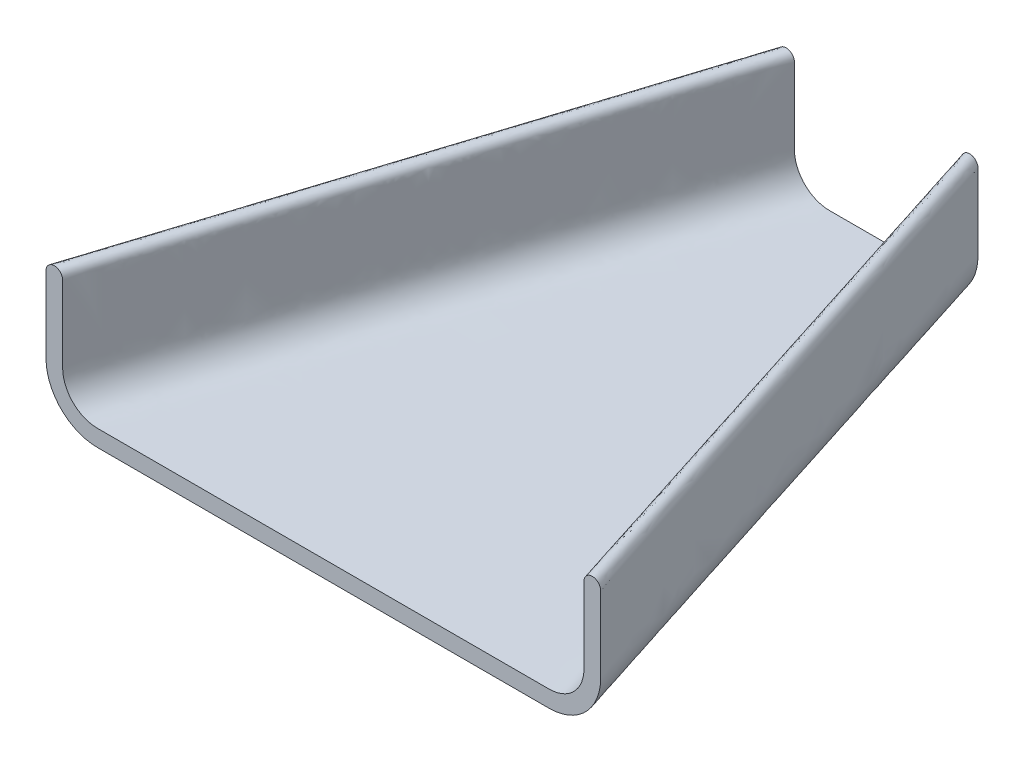
ISO-10303-21;
HEADER;
FILE_DESCRIPTION(('STEP AP214'),'2;1');
FILE_NAME('part.step','',(''),(''),'','','');
FILE_SCHEMA(('AUTOMOTIVE_DESIGN { 1 0 10303 214 1 1 1 1 }'));
ENDSEC;
DATA;
#1=APPLICATION_CONTEXT('core data for automotive mechanical design processes');
#2=APPLICATION_PROTOCOL_DEFINITION('international standard','automotive_design',2000,#1);
#3=PRODUCT_CONTEXT('',#1,'mechanical');
#4=PRODUCT('Part','Part','',(#3));
#5=PRODUCT_RELATED_PRODUCT_CATEGORY('part','',(#4));
#6=PRODUCT_DEFINITION_FORMATION('','',#4);
#7=PRODUCT_DEFINITION_CONTEXT('part definition',#1,'design');
#8=PRODUCT_DEFINITION('design','',#6,#7);
#9=PRODUCT_DEFINITION_SHAPE('','',#8);
#10=(LENGTH_UNIT() NAMED_UNIT(*) SI_UNIT(.MILLI.,.METRE.));
#11=(NAMED_UNIT(*) PLANE_ANGLE_UNIT() SI_UNIT($,.RADIAN.));
#12=(NAMED_UNIT(*) SI_UNIT($,.STERADIAN.) SOLID_ANGLE_UNIT());
#13=UNCERTAINTY_MEASURE_WITH_UNIT(LENGTH_MEASURE(1.E-05),#10,'distance_accuracy_value','');
#14=(GEOMETRIC_REPRESENTATION_CONTEXT(3) GLOBAL_UNCERTAINTY_ASSIGNED_CONTEXT((#13)) GLOBAL_UNIT_ASSIGNED_CONTEXT((#10,
#11,#12)) REPRESENTATION_CONTEXT('',''));
#15=CARTESIAN_POINT('',(0.,0.,0.));
#16=DIRECTION('',(0.,0.,1.));
#17=DIRECTION('',(1.,0.,0.));
#18=AXIS2_PLACEMENT_3D('',#15,#16,#17);
#19=CARTESIAN_POINT('',(16.542930344424,20.,0.));
#20=DIRECTION('',(0.,0.,1.));
#21=DIRECTION('',(1.,0.,0.));
#22=AXIS2_PLACEMENT_3D('',#19,#20,#21);
#23=PLANE('',#22);
#24=CARTESIAN_POINT('',(16.542930344424,20.,0.));
#25=DIRECTION('',(0.,0.,1.));
#26=DIRECTION('',(1.,0.,0.));
#27=AXIS2_PLACEMENT_3D('',#24,#25,#26);
#28=CIRCLE('',#27,1.5);
#29=CARTESIAN_POINT('',(18.042930344424,20.,0.));
#30=VERTEX_POINT('',#29);
#31=CARTESIAN_POINT('',(15.042930344424,20.,0.));
#32=VERTEX_POINT('',#31);
#33=EDGE_CURVE('E571',#30,#32,#28,.T.);
#34=ORIENTED_EDGE('',*,*,#33,.F.);
#35=DIRECTION('',(0.,1.,0.));
#36=VECTOR('',#35,1.);
#37=CARTESIAN_POINT('',(18.042930344424,6.29395077731458,0.));
#38=LINE('',#37,#36);
#39=CARTESIAN_POINT('',(18.0429303444241,6.29395077731458,0.));
#40=VERTEX_POINT('',#39);
#41=EDGE_CURVE('E382',#40,#30,#38,.T.);
#42=ORIENTED_EDGE('',*,*,#41,.F.);
#43=CARTESIAN_POINT('',(8.74897956710952,6.29395077731458,0.));
#44=DIRECTION('',(0.,0.,1.));
#45=DIRECTION('',(-1.,0.,0.));
#46=AXIS2_PLACEMENT_3D('',#43,#44,#45);
#47=CIRCLE('',#46,9.29395077731455);
#48=CARTESIAN_POINT('',(8.74897956710946,-3.,0.));
#49=VERTEX_POINT('',#48);
#50=EDGE_CURVE('E692',#49,#40,#47,.T.);
#51=ORIENTED_EDGE('',*,*,#50,.F.);
#52=DIRECTION('',(1.,0.,0.));
#53=VECTOR('',#52,1.);
#54=CARTESIAN_POINT('',(8.74897956710946,-3.,0.));
#55=LINE('',#54,#53);
#56=CARTESIAN_POINT('',(-8.74897956710943,-2.99999999999993,0.));
#57=VERTEX_POINT('',#56);
#58=EDGE_CURVE('E709',#57,#49,#55,.T.);
#59=ORIENTED_EDGE('',*,*,#58,.F.);
#60=CARTESIAN_POINT('',(-8.74897956710952,6.29395077731458,0.));
#61=DIRECTION('',(0.,0.,1.));
#62=DIRECTION('',(1.,0.,0.));
#63=AXIS2_PLACEMENT_3D('',#60,#61,#62);
#64=CIRCLE('',#63,9.29395077731452);
#65=CARTESIAN_POINT('',(-18.042930344424,6.29395077731458,0.));
#66=VERTEX_POINT('',#65);
#67=EDGE_CURVE('E712',#66,#57,#64,.T.);
#68=ORIENTED_EDGE('',*,*,#67,.F.);
#69=DIRECTION('',(0.,-1.,0.));
#70=VECTOR('',#69,1.);
#71=CARTESIAN_POINT('',(-18.042930344424,6.29395077731458,0.));
#72=LINE('',#71,#70);
#73=CARTESIAN_POINT('',(-18.042930344424,20.,0.));
#74=VERTEX_POINT('',#73);
#75=EDGE_CURVE('E730',#74,#66,#72,.T.);
#76=ORIENTED_EDGE('',*,*,#75,.F.);
#77=CARTESIAN_POINT('',(-16.542930344424,20.,0.));
#78=DIRECTION('',(0.,0.,1.));
#79=DIRECTION('',(-1.,0.,0.));
#80=AXIS2_PLACEMENT_3D('',#77,#78,#79);
#81=CIRCLE('',#80,1.5);
#82=CARTESIAN_POINT('',(-15.042930344424,20.,0.));
#83=VERTEX_POINT('',#82);
#84=EDGE_CURVE('E733',#83,#74,#81,.T.);
#85=ORIENTED_EDGE('',*,*,#84,.F.);
#86=DIRECTION('',(0.,1.,0.));
#87=VECTOR('',#86,1.);
#88=CARTESIAN_POINT('',(-15.042930344424,6.29395077731458,0.));
#89=LINE('',#88,#87);
#90=CARTESIAN_POINT('',(-15.0429303444241,6.29395077731458,0.));
#91=VERTEX_POINT('',#90);
#92=EDGE_CURVE('E751',#91,#83,#89,.T.);
#93=ORIENTED_EDGE('',*,*,#92,.F.);
#94=CARTESIAN_POINT('',(-8.74897956710952,6.29395077731458,0.));
#95=DIRECTION('',(0.,0.,-1.));
#96=DIRECTION('',(1.,0.,0.));
#97=AXIS2_PLACEMENT_3D('',#94,#95,#96);
#98=CIRCLE('',#97,6.29395077731455);
#99=CARTESIAN_POINT('',(-8.74897956710946,0.,0.));
#100=VERTEX_POINT('',#99);
#101=EDGE_CURVE('E754',#100,#91,#98,.T.);
#102=ORIENTED_EDGE('',*,*,#101,.F.);
#103=DIRECTION('',(-1.,0.,0.));
#104=VECTOR('',#103,1.);
#105=CARTESIAN_POINT('',(8.74897956710946,0.,0.));
#106=LINE('',#105,#104);
#107=CARTESIAN_POINT('',(8.74897956710946,0.,0.));
#108=VERTEX_POINT('',#107);
#109=EDGE_CURVE('E772',#108,#100,#106,.T.);
#110=ORIENTED_EDGE('',*,*,#109,.F.);
#111=CARTESIAN_POINT('',(8.74897956710952,6.29395077731458,0.));
#112=DIRECTION('',(0.,0.,-1.));
#113=DIRECTION('',(-1.,0.,0.));
#114=AXIS2_PLACEMENT_3D('',#111,#112,#113);
#115=CIRCLE('',#114,6.29395077731455);
#116=CARTESIAN_POINT('',(15.042930344424,6.29395077731458,0.));
#117=VERTEX_POINT('',#116);
#118=EDGE_CURVE('E775',#117,#108,#115,.T.);
#119=ORIENTED_EDGE('',*,*,#118,.F.);
#120=DIRECTION('',(0.,-1.,0.));
#121=VECTOR('',#120,1.);
#122=CARTESIAN_POINT('',(15.042930344424,6.29395077731458,0.));
#123=LINE('',#122,#121);
#124=EDGE_CURVE('E792',#32,#117,#123,.T.);
#125=ORIENTED_EDGE('',*,*,#124,.F.);
#126=EDGE_LOOP('',(#34,#42,#51,#59,#68,#76,#85,#93,#102,#110,#119,#125));
#127=FACE_BOUND('',#126,.T.);
#128=ADVANCED_FACE('F323',(#127),#23,.F.);
#129=CARTESIAN_POINT('',(48.5,20.,100.));
#130=DIRECTION('',(0.,0.,-1.));
#131=DIRECTION('',(-1.,0.,0.));
#132=AXIS2_PLACEMENT_3D('',#129,#130,#131);
#133=PLANE('',#132);
#134=CARTESIAN_POINT('',(48.5,20.,100.));
#135=DIRECTION('',(0.,0.,1.));
#136=DIRECTION('',(-1.,0.,0.));
#137=AXIS2_PLACEMENT_3D('',#134,#135,#136);
#138=CIRCLE('',#137,1.5);
#139=CARTESIAN_POINT('',(50.,20.,100.));
#140=VERTEX_POINT('',#139);
#141=CARTESIAN_POINT('',(47.,20.,100.));
#142=VERTEX_POINT('',#141);
#143=EDGE_CURVE('E582',#140,#142,#138,.T.);
#144=ORIENTED_EDGE('',*,*,#143,.T.);
#145=DIRECTION('',(0.,-1.,0.));
#146=VECTOR('',#145,1.);
#147=CARTESIAN_POINT('',(47.,6.29395077731458,100.));
#148=LINE('',#147,#146);
#149=CARTESIAN_POINT('',(47.,6.29395077731459,100.));
#150=VERTEX_POINT('',#149);
#151=EDGE_CURVE('E12',#142,#150,#148,.T.);
#152=ORIENTED_EDGE('',*,*,#151,.T.);
#153=CARTESIAN_POINT('',(40.7060492226855,6.29395077731458,100.));
#154=DIRECTION('',(0.,0.,-1.));
#155=DIRECTION('',(-1.,0.,0.));
#156=AXIS2_PLACEMENT_3D('',#153,#154,#155);
#157=CIRCLE('',#156,6.29395077731452);
#158=CARTESIAN_POINT('',(40.7060492226855,0.,100.));
#159=VERTEX_POINT('',#158);
#160=EDGE_CURVE('E334',#150,#159,#157,.T.);
#161=ORIENTED_EDGE('',*,*,#160,.T.);
#162=DIRECTION('',(-1.,0.,0.));
#163=VECTOR('',#162,1.);
#164=CARTESIAN_POINT('',(40.7060492226855,0.,100.));
#165=LINE('',#164,#163);
#166=CARTESIAN_POINT('',(-40.7060492226855,0.,100.));
#167=VERTEX_POINT('',#166);
#168=EDGE_CURVE('E424',#159,#167,#165,.T.);
#169=ORIENTED_EDGE('',*,*,#168,.T.);
#170=CARTESIAN_POINT('',(-40.7060492226855,6.29395077731458,100.));
#171=DIRECTION('',(0.,0.,-1.));
#172=DIRECTION('',(1.,0.,0.));
#173=AXIS2_PLACEMENT_3D('',#170,#171,#172);
#174=CIRCLE('',#173,6.29395077731452);
#175=CARTESIAN_POINT('',(-47.,6.29395077731458,100.));
#176=VERTEX_POINT('',#175);
#177=EDGE_CURVE('E434',#167,#176,#174,.T.);
#178=ORIENTED_EDGE('',*,*,#177,.T.);
#179=DIRECTION('',(0.,1.,0.));
#180=VECTOR('',#179,1.);
#181=CARTESIAN_POINT('',(-47.,6.29395077731458,100.));
#182=LINE('',#181,#180);
#183=CARTESIAN_POINT('',(-47.,20.,100.));
#184=VERTEX_POINT('',#183);
#185=EDGE_CURVE('E605',#176,#184,#182,.T.);
#186=ORIENTED_EDGE('',*,*,#185,.T.);
#187=CARTESIAN_POINT('',(-48.5,20.,100.));
#188=DIRECTION('',(0.,0.,1.));
#189=DIRECTION('',(-1.,0.,0.));
#190=AXIS2_PLACEMENT_3D('',#187,#188,#189);
#191=CIRCLE('',#190,1.5);
#192=CARTESIAN_POINT('',(-50.,20.,100.));
#193=VERTEX_POINT('',#192);
#194=EDGE_CURVE('E622',#184,#193,#191,.T.);
#195=ORIENTED_EDGE('',*,*,#194,.T.);
#196=DIRECTION('',(0.,-1.,0.));
#197=VECTOR('',#196,1.);
#198=CARTESIAN_POINT('',(-50.,6.29395077731458,100.));
#199=LINE('',#198,#197);
#200=CARTESIAN_POINT('',(-50.,6.29395077731459,100.));
#201=VERTEX_POINT('',#200);
#202=EDGE_CURVE('E625',#193,#201,#199,.T.);
#203=ORIENTED_EDGE('',*,*,#202,.T.);
#204=CARTESIAN_POINT('',(-40.7060492226855,6.29395077731458,100.));
#205=DIRECTION('',(0.,0.,1.));
#206=DIRECTION('',(1.,0.,0.));
#207=AXIS2_PLACEMENT_3D('',#204,#205,#206);
#208=CIRCLE('',#207,9.29395077731452);
#209=CARTESIAN_POINT('',(-40.7060492226855,-2.99999999999993,100.));
#210=VERTEX_POINT('',#209);
#211=EDGE_CURVE('E643',#201,#210,#208,.T.);
#212=ORIENTED_EDGE('',*,*,#211,.T.);
#213=DIRECTION('',(1.,0.,0.));
#214=VECTOR('',#213,1.);
#215=CARTESIAN_POINT('',(40.7060492226855,-2.99999999999993,100.));
#216=LINE('',#215,#214);
#217=CARTESIAN_POINT('',(40.7060492226855,-2.99999999999994,100.));
#218=VERTEX_POINT('',#217);
#219=EDGE_CURVE('E646',#210,#218,#216,.T.);
#220=ORIENTED_EDGE('',*,*,#219,.T.);
#221=CARTESIAN_POINT('',(40.7060492226855,6.29395077731458,100.));
#222=DIRECTION('',(0.,0.,1.));
#223=DIRECTION('',(-1.,0.,0.));
#224=AXIS2_PLACEMENT_3D('',#221,#222,#223);
#225=CIRCLE('',#224,9.29395077731452);
#226=CARTESIAN_POINT('',(50.,6.29395077731458,100.));
#227=VERTEX_POINT('',#226);
#228=EDGE_CURVE('E396',#218,#227,#225,.T.);
#229=ORIENTED_EDGE('',*,*,#228,.T.);
#230=DIRECTION('',(0.,1.,0.));
#231=VECTOR('',#230,1.);
#232=CARTESIAN_POINT('',(50.,6.29395077731458,100.));
#233=LINE('',#232,#231);
#234=EDGE_CURVE('E664',#227,#140,#233,.T.);
#235=ORIENTED_EDGE('',*,*,#234,.T.);
#236=EDGE_LOOP('',(#144,#152,#161,#169,#178,#186,#195,#203,#212,#220,#229,#235));
#237=FACE_BOUND('',#236,.T.);
#238=ADVANCED_FACE('F423',(#237),#133,.F.);
#239=CARTESIAN_POINT('',(50.,19.999999998663,100.));
#240=CARTESIAN_POINT('',(18.042930344424,19.999999998663,0.));
#241=CARTESIAN_POINT('',(50.,18.8578292314429,100.));
#242=CARTESIAN_POINT('',(18.042930344424,18.8578292314429,0.));
#243=CARTESIAN_POINT('',(50.,16.5734876943287,100.));
#244=CARTESIAN_POINT('',(18.042930344424,16.5734876943286,0.));
#245=CARTESIAN_POINT('',(50.,13.1469753886573,99.9999999999998));
#246=CARTESIAN_POINT('',(18.0429303444241,13.1469753886573,0.));
#247=CARTESIAN_POINT('',(50.,9.72046308298594,100.));
#248=CARTESIAN_POINT('',(18.042930344424,9.72046308298595,0.));
#249=CARTESIAN_POINT('',(50.,7.4361215458717,100.));
#250=CARTESIAN_POINT('',(18.042930344424,7.4361215458717,0.));
#251=CARTESIAN_POINT('',(50.,5.68566312533838,100.));
#252=CARTESIAN_POINT('',(18.0429303444241,5.68566312533838,0.));
#253=CARTESIAN_POINT('',(49.8825699201602,4.53366509057306,100.));
#254=CARTESIAN_POINT('',(17.9253386328897,4.36002704274886,0.));
#255=CARTESIAN_POINT('',(49.4301439600059,2.95732924128206,100.));
#256=CARTESIAN_POINT('',(17.1854262661475,2.14629958613332,0.));
#257=CARTESIAN_POINT('',(48.7321299519958,1.51884081533093,100.));
#258=CARTESIAN_POINT('',(15.8325540593502,0.12704362948251,0.));
#259=CARTESIAN_POINT('',(47.9546812795262,0.433445241536176,100.));
#260=CARTESIAN_POINT('',(14.4747003469939,-1.07731235442002,0.));
#261=CARTESIAN_POINT('',(47.2102428896823,-0.36188075218266,100.));
#262=CARTESIAN_POINT('',(13.4063591227669,-1.7663939407779,0.));
#263=CARTESIAN_POINT('',(46.5870871794764,-0.919311576530071,100.));
#264=CARTESIAN_POINT('',(12.6273560435513,-2.16560625194271,0.));
#265=CARTESIAN_POINT('',(45.8936023635969,-1.43412976027311,100.));
#266=CARTESIAN_POINT('',(11.8838877694159,-2.46682240628237,0.));
#267=CARTESIAN_POINT('',(45.1220447071405,-1.90150554463326,100.));
#268=CARTESIAN_POINT('',(11.1784290264897,-2.68597390112525,0.));
#269=CARTESIAN_POINT('',(44.2577333597661,-2.31315591659491,99.9999999999999));
#270=CARTESIAN_POINT('',(10.5134545409021,-2.83899223379972,0.));
#271=CARTESIAN_POINT('',(43.2820445231359,-2.65852919991347,100.));
#272=CARTESIAN_POINT('',(9.88721581152224,-2.93665405023179,0.));
#273=CARTESIAN_POINT('',(42.1493071113567,-2.91388784260737,99.9999999999999));
#274=CARTESIAN_POINT('',(9.29796433721957,-2.98973599634747,0.));
#275=CARTESIAN_POINT('',(41.2425850487104,-2.99999999999994,100.));
#276=CARTESIAN_POINT('',(8.9283456443705,-2.99999999999997,0.));
#277=CARTESIAN_POINT('',(34.8512756917669,-2.99999999999993,100.));
#278=CARTESIAN_POINT('',(6.79170530776879,-2.99999999999999,0.));
#279=CARTESIAN_POINT('',(22.0772925383462,-2.99999999999993,99.9999999999999));
#280=CARTESIAN_POINT('',(3.9054651450008,-2.99999999999998,0.));
#281=CARTESIAN_POINT('',(0.,-2.99999999999993,100.));
#282=CARTESIAN_POINT('',(0.,-2.99999999999997,0.));
#283=CARTESIAN_POINT('',(-22.0772925383462,-2.99999999999993,99.9999999999999));
#284=CARTESIAN_POINT('',(-3.90546514500079,-2.99999999999995,0.));
#285=CARTESIAN_POINT('',(-34.8512756917669,-2.99999999999993,100.));
#286=CARTESIAN_POINT('',(-6.79170530776876,-2.99999999999994,0.));
#287=CARTESIAN_POINT('',(-41.2425850487104,-2.99999999999994,100.));
#288=CARTESIAN_POINT('',(-8.92834564437047,-2.99999999999994,0.));
#289=CARTESIAN_POINT('',(-42.1493071113567,-2.91388784260737,100.));
#290=CARTESIAN_POINT('',(-9.29796433721954,-2.98973599634744,0.));
#291=CARTESIAN_POINT('',(-43.282044523136,-2.65852919991347,100.));
#292=CARTESIAN_POINT('',(-9.8872158115222,-2.93665405023176,0.));
#293=CARTESIAN_POINT('',(-44.2577333597661,-2.31315591659491,99.9999999999998));
#294=CARTESIAN_POINT('',(-10.513454540902,-2.83899223379969,0.));
#295=CARTESIAN_POINT('',(-45.1220447071406,-1.90150554463327,100.));
#296=CARTESIAN_POINT('',(-11.1784290264897,-2.68597390112522,0.));
#297=CARTESIAN_POINT('',(-45.8936023635967,-1.43412976027311,99.9999999999997));
#298=CARTESIAN_POINT('',(-11.8838877694158,-2.46682240628235,0.));
#299=CARTESIAN_POINT('',(-46.5870871794766,-0.919311576530093,100.));
#300=CARTESIAN_POINT('',(-12.6273560435513,-2.16560625194269,0.));
#301=CARTESIAN_POINT('',(-47.2102428896822,-0.361880752182655,99.9999999999998));
#302=CARTESIAN_POINT('',(-13.4063591227669,-1.76639394077788,0.));
#303=CARTESIAN_POINT('',(-47.9546812795263,0.433445241536191,100.));
#304=CARTESIAN_POINT('',(-14.4747003469939,-1.07731235442,0.));
#305=CARTESIAN_POINT('',(-48.7321299519958,1.51884081533094,100.));
#306=CARTESIAN_POINT('',(-15.8325540593501,0.127043629482522,0.));
#307=CARTESIAN_POINT('',(-49.4301439600059,2.95732924128206,100.));
#308=CARTESIAN_POINT('',(-17.1854262661476,2.14629958613334,0.));
#309=CARTESIAN_POINT('',(-49.8825699201602,4.53366509057307,100.));
#310=CARTESIAN_POINT('',(-17.9253386328896,4.36002704274886,0.));
#311=CARTESIAN_POINT('',(-50.,5.68566312533838,100.));
#312=CARTESIAN_POINT('',(-18.042930344424,5.68566312533838,0.));
#313=CARTESIAN_POINT('',(-50.,7.4361215458717,100.));
#314=CARTESIAN_POINT('',(-18.042930344424,7.43612154587171,0.));
#315=CARTESIAN_POINT('',(-50.,9.72046308298593,100.));
#316=CARTESIAN_POINT('',(-18.042930344424,9.72046308298596,0.));
#317=CARTESIAN_POINT('',(-50.,13.1469753886573,100.));
#318=CARTESIAN_POINT('',(-18.042930344424,13.1469753886573,0.));
#319=CARTESIAN_POINT('',(-50.,16.5734876943286,100.));
#320=CARTESIAN_POINT('',(-18.042930344424,16.5734876943287,0.));
#321=CARTESIAN_POINT('',(-50.,18.8578292314429,100.));
#322=CARTESIAN_POINT('',(-18.042930344424,18.8578292314429,0.));
#323=CARTESIAN_POINT('',(-50.,20.1963495392825,100.));
#324=CARTESIAN_POINT('',(-18.042930344424,20.1963495392825,0.));
#325=CARTESIAN_POINT('',(-49.922003383986,20.588925468703,100.));
#326=CARTESIAN_POINT('',(-17.9649337284101,20.588925468703,0.));
#327=CARTESIAN_POINT('',(-49.5883206779812,21.088294672356,100.));
#328=CARTESIAN_POINT('',(-17.6312510224051,21.088294672356,0.));
#329=CARTESIAN_POINT('',(-49.0890286629882,21.4219276690566,100.));
#330=CARTESIAN_POINT('',(-17.1319590074122,21.4219276690567,0.));
#331=CARTESIAN_POINT('',(-48.5,21.5391167795175,99.9999999999999));
#332=CARTESIAN_POINT('',(-16.542930344424,21.5391167795174,0.));
#333=CARTESIAN_POINT('',(-47.9109713370118,21.4219276690567,100.));
#334=CARTESIAN_POINT('',(-15.9539016814359,21.4219276690567,0.));
#335=CARTESIAN_POINT('',(-47.4116793220188,21.088294672356,99.9999999999997));
#336=CARTESIAN_POINT('',(-15.4546096664429,21.088294672356,0.));
#337=CARTESIAN_POINT('',(-47.0779966160141,20.588925468703,100.));
#338=CARTESIAN_POINT('',(-15.120926960438,20.588925468703,0.));
#339=CARTESIAN_POINT('',(-47.,20.1963495392825,100.));
#340=CARTESIAN_POINT('',(-15.042930344424,20.1963495392825,0.));
#341=CARTESIAN_POINT('',(-47.,18.8578292314429,100.));
#342=CARTESIAN_POINT('',(-15.042930344424,18.8578292314429,0.));
#343=CARTESIAN_POINT('',(-47.,16.5734876943286,100.));
#344=CARTESIAN_POINT('',(-15.042930344424,16.5734876943286,0.));
#345=CARTESIAN_POINT('',(-47.,13.1469753886573,99.9999999999999));
#346=CARTESIAN_POINT('',(-15.042930344424,13.1469753886573,0.));
#347=CARTESIAN_POINT('',(-47.,9.72046308298592,100.));
#348=CARTESIAN_POINT('',(-15.042930344424,9.72046308298595,0.));
#349=CARTESIAN_POINT('',(-47.,7.4361215458717,100.));
#350=CARTESIAN_POINT('',(-15.042930344424,7.4361215458717,0.));
#351=CARTESIAN_POINT('',(-47.,5.88201266491017,100.));
#352=CARTESIAN_POINT('',(-15.0429303444241,5.88201266491017,0.));
#353=CARTESIAN_POINT('',(-46.9205775648785,5.10404675924423,100.));
#354=CARTESIAN_POINT('',(-14.9651704546356,4.97244858121912,0.));
#355=CARTESIAN_POINT('',(-46.616569705205,4.04186129316876,100.));
#356=CARTESIAN_POINT('',(-14.426942350523,3.39356601317859,0.));
#357=CARTESIAN_POINT('',(-46.1485603140774,3.07314053381272,99.9999999999999));
#358=CARTESIAN_POINT('',(-13.4229507976012,1.97310345912587,0.));
#359=CARTESIAN_POINT('',(-45.627746407008,2.34145875803284,100.));
#360=CARTESIAN_POINT('',(-12.4710214411584,1.18707185197433,0.));
#361=CARTESIAN_POINT('',(-45.1287191672775,1.80436012658664,100.));
#362=CARTESIAN_POINT('',(-11.7501916074446,0.750661439859971,0.));
#363=CARTESIAN_POINT('',(-44.7107846879087,1.42720314169401,100.));
#364=CARTESIAN_POINT('',(-11.2349029266896,0.503244697811797,0.));
#365=CARTESIAN_POINT('',(-44.2449743100732,1.07804811210398,100.));
#366=CARTESIAN_POINT('',(-10.7499248092749,0.31940265303537,0.));
#367=CARTESIAN_POINT('',(-43.7261098905729,0.759851856499558,99.9999999999998));
#368=CARTESIAN_POINT('',(-10.2947782740661,0.187451080616624,0.));
#369=CARTESIAN_POINT('',(-43.1428103353389,0.478388956702905,100.));
#370=CARTESIAN_POINT('',(-9.86898433992828,0.0957057556414825,0.));
#371=CARTESIAN_POINT('',(-42.4824864852802,0.240216961644608,99.9999999999999));
#372=CARTESIAN_POINT('',(-9.47027667991423,0.0374621882537071,0.));
#373=CARTESIAN_POINT('',(-41.7093318638814,0.0622614786867903,100.));
#374=CARTESIAN_POINT('',(-9.09638896707652,0.00601588859705895,0.));
#375=CARTESIAN_POINT('',(-41.0843144958792,0.,100.));
#376=CARTESIAN_POINT('',(-8.86243797721806,0.,0.));
#377=CARTESIAN_POINT('',(-34.6108925580216,0.,100.));
#378=CARTESIAN_POINT('',(-6.92077371914241,0.,0.));
#379=CARTESIAN_POINT('',(-21.5606299436071,0.,100.));
#380=CARTESIAN_POINT('',(-3.98434471637314,0.,0.));
#381=CARTESIAN_POINT('',(0.,0.,99.9999999999999));
#382=CARTESIAN_POINT('',(0.,0.,0.));
#383=CARTESIAN_POINT('',(21.5606299436071,0.,100.));
#384=CARTESIAN_POINT('',(3.98434471637314,0.,0.));
#385=CARTESIAN_POINT('',(34.6108925580216,0.,100.));
#386=CARTESIAN_POINT('',(6.92077371914241,0.,0.));
#387=CARTESIAN_POINT('',(41.0843144958792,0.,100.));
#388=CARTESIAN_POINT('',(8.86243797721806,0.,0.));
#389=CARTESIAN_POINT('',(41.7093318638814,0.06226147868679,100.));
#390=CARTESIAN_POINT('',(9.09638896707652,0.00601588859705939,0.));
#391=CARTESIAN_POINT('',(42.4824864852802,0.240216961644613,100.));
#392=CARTESIAN_POINT('',(9.47027667991423,0.0374621882537079,0.));
#393=CARTESIAN_POINT('',(43.1428103353389,0.478388956702892,100.));
#394=CARTESIAN_POINT('',(9.86898433992827,0.0957057556414819,0.));
#395=CARTESIAN_POINT('',(43.7261098905729,0.759851856499542,99.9999999999999));
#396=CARTESIAN_POINT('',(10.294778274066,0.18745108061662,0.));
#397=CARTESIAN_POINT('',(44.2449743100731,1.07804811210397,100.));
#398=CARTESIAN_POINT('',(10.7499248092749,0.319402653035363,0.));
#399=CARTESIAN_POINT('',(44.7107846879086,1.42720314169398,99.9999999999999));
#400=CARTESIAN_POINT('',(11.2349029266895,0.503244697811781,0.));
#401=CARTESIAN_POINT('',(45.1287191672775,1.80436012658662,100.));
#402=CARTESIAN_POINT('',(11.7501916074446,0.750661439859957,0.));
#403=CARTESIAN_POINT('',(45.6277464070079,2.34145875803283,99.9999999999999));
#404=CARTESIAN_POINT('',(12.4710214411583,1.18707185197432,0.));
#405=CARTESIAN_POINT('',(46.1485603140774,3.07314053381273,100.));
#406=CARTESIAN_POINT('',(13.4229507976012,1.97310345912587,0.));
#407=CARTESIAN_POINT('',(46.616569705205,4.04186129316877,100.));
#408=CARTESIAN_POINT('',(14.426942350523,3.39356601317858,0.));
#409=CARTESIAN_POINT('',(46.9205775648785,5.10404675924426,100.));
#410=CARTESIAN_POINT('',(14.9651704546357,4.97244858121912,0.));
#411=CARTESIAN_POINT('',(47.,5.88201266491018,100.));
#412=CARTESIAN_POINT('',(15.0429303444241,5.88201266491017,0.));
#413=CARTESIAN_POINT('',(47.,7.4361215458717,100.));
#414=CARTESIAN_POINT('',(15.042930344424,7.4361215458717,0.));
#415=CARTESIAN_POINT('',(47.0000000000001,9.72046308298595,100.));
#416=CARTESIAN_POINT('',(15.0429303444241,9.72046308298594,0.));
#417=CARTESIAN_POINT('',(46.9999999999999,13.1469753886573,100.));
#418=CARTESIAN_POINT('',(15.042930344424,13.1469753886573,0.));
#419=CARTESIAN_POINT('',(47.,16.5734876943287,100.));
#420=CARTESIAN_POINT('',(15.042930344424,16.5734876943286,0.));
#421=CARTESIAN_POINT('',(47.,18.8578292314429,100.));
#422=CARTESIAN_POINT('',(15.042930344424,18.8578292314429,0.));
#423=CARTESIAN_POINT('',(47.,20.1963495392825,100.));
#424=CARTESIAN_POINT('',(15.042930344424,20.1963495392825,0.));
#425=CARTESIAN_POINT('',(47.0779966160139,20.588925468703,100.));
#426=CARTESIAN_POINT('',(15.120926960438,20.588925468703,0.));
#427=CARTESIAN_POINT('',(47.4116793220189,21.088294672356,100.));
#428=CARTESIAN_POINT('',(15.4546096664429,21.0882946723559,0.));
#429=CARTESIAN_POINT('',(47.9109713370117,21.4219276690567,99.9999999999999));
#430=CARTESIAN_POINT('',(15.9539016814358,21.4219276690567,0.));
#431=CARTESIAN_POINT('',(48.5000000000001,21.5391167795175,100.));
#432=CARTESIAN_POINT('',(16.5429303444241,21.5391167795175,0.));
#433=CARTESIAN_POINT('',(49.0890286629881,21.4219276690567,99.9999999999997));
#434=CARTESIAN_POINT('',(17.1319590074122,21.4219276690567,0.));
#435=CARTESIAN_POINT('',(49.5883206779813,21.088294672356,100.));
#436=CARTESIAN_POINT('',(17.6312510224052,21.088294672356,0.));
#437=CARTESIAN_POINT('',(49.9220033839859,20.588925468703,99.9999999999998));
#438=CARTESIAN_POINT('',(17.96493372841,20.588925468703,0.));
#439=CARTESIAN_POINT('',(50.,20.1963495392825,100.));
#440=CARTESIAN_POINT('',(18.042930344424,20.1963495392825,0.));
#441=CARTESIAN_POINT('',(50.,19.999999998663,100.));
#442=CARTESIAN_POINT('',(18.042930344424,19.999999998663,0.));
#443=B_SPLINE_SURFACE_WITH_KNOTS('',3,1,((#239,#240),(#241,#242),(#243,#244),(#245,#246),(#247,
#248),(#249,#250),(#251,#252),(#253,#254),(#255,#256),(#257,#258),(#259,#260),(#261,#262),(#263,
#264),(#265,#266),(#267,#268),(#269,#270),(#271,#272),(#273,#274),(#275,#276),(#277,#278),(#279,
#280),(#281,#282),(#283,#284),(#285,#286),(#287,#288),(#289,#290),(#291,#292),(#293,#294),(#295,
#296),(#297,#298),(#299,#300),(#301,#302),(#303,#304),(#305,#306),(#307,#308),(#309,#310),(#311,
#312),(#313,#314),(#315,#316),(#317,#318),(#319,#320),(#321,#322),(#323,#324),(#325,#326),(#327,
#328),(#329,#330),(#331,#332),(#333,#334),(#335,#336),(#337,#338),(#339,#340),(#341,#342),(#343,
#344),(#345,#346),(#347,#348),(#349,#350),(#351,#352),(#353,#354),(#355,#356),(#357,#358),(#359,
#360),(#361,#362),(#363,#364),(#365,#366),(#367,#368),(#369,#370),(#371,#372),(#373,#374),(#375,
#376),(#377,#378),(#379,#380),(#381,#382),(#383,#384),(#385,#386),(#387,#388),(#389,#390),(#391,
#392),(#393,#394),(#395,#396),(#397,#398),(#399,#400),(#401,#402),(#403,#404),(#405,#406),(#407,
#408),(#409,#410),(#411,#412),(#413,#414),(#415,#416),(#417,#418),(#419,#420),(#421,#422),(#423,
#424),(#425,#426),(#427,#428),(#429,#430),(#431,#432),(#433,#434),(#435,#436),(#437,#438),(#439,
#440),(#441,#442)),.UNSPECIFIED.,.T.,.F.,.F.,(4,1,1,1,2,1,1,1,1,1,1,1,1,1,1,1,2,1,1,1,2,1,1,1,1,
1,1,1,1,1,1,1,2,1,1,1,2,1,1,1,1,1,1,1,2,1,1,1,2,1,1,1,1,1,1,1,1,1,1,1,2,1,1,1,2,1,1,1,1,1,1,1,1,
1,1,1,2,1,1,1,2,1,1,1,1,1,1,1,4),(2,2),(0.,0.0177656661685473,0.0355313323370947,
0.053296998505642,0.0710626646741894,0.080524153032384,0.0899856413905786,0.0994471297487731,
0.108908618106968,0.113639362286065,0.118370106465162,0.12310085064426,0.127831594823357,
0.132562339002454,0.137293083181551,0.142023827360649,0.146754571539746,0.198377285769873,0.25,
0.301622714230127,0.353245428460254,0.357976172639351,0.362706916818449,0.367437660997546,
0.372168405176643,0.37689914935574,0.381629893534838,0.386360637713935,0.391091381893032,
0.400552870251227,0.410014358609421,0.419475846967616,0.428937335325811,0.446703001494358,
0.464468667662905,0.482234333831453,0.5,0.503054079557196,0.506108159114392,0.509162238671588,
0.512216318228784,0.51527039778598,0.518324477343177,0.521378556900373,0.524432636457569,
0.542198302626116,0.559963968794664,0.577729634963211,0.595495301131759,0.601902709932757,
0.608310118733755,0.614717527534754,0.621124936335752,0.624328640736251,0.62753234513675,
0.63073604953725,0.633939753937749,0.637143458338248,0.640347162738747,0.643550867139247,
0.646754571539746,0.698377285769873,0.75,0.801622714230127,0.853245428460254,0.856449132860753,
0.859652837261252,0.862856541661752,0.866060246062251,0.86926395046275,0.872467654863249,
0.875671359263748,0.878875063664248,0.885282472465246,0.891689881266244,0.898097290067243,
0.904504698868241,0.922270365036789,0.940036031205336,0.957801697373883,0.975567363542431,
0.978621443099627,0.981675522656823,0.984729602214019,0.987783681771215,0.990837761328412,
0.993891840885608,0.996945920442804,1.),(0.,1.),.UNSPECIFIED.);
#444=ORIENTED_EDGE('',*,*,#143,.F.);
#445=ORIENTED_EDGE('',*,*,#234,.F.);
#446=ORIENTED_EDGE('',*,*,#228,.F.);
#447=ORIENTED_EDGE('',*,*,#219,.F.);
#448=ORIENTED_EDGE('',*,*,#211,.F.);
#449=ORIENTED_EDGE('',*,*,#202,.F.);
#450=ORIENTED_EDGE('',*,*,#194,.F.);
#451=ORIENTED_EDGE('',*,*,#185,.F.);
#452=ORIENTED_EDGE('',*,*,#177,.F.);
#453=ORIENTED_EDGE('',*,*,#168,.F.);
#454=ORIENTED_EDGE('',*,*,#160,.F.);
#455=ORIENTED_EDGE('',*,*,#151,.F.);
#456=EDGE_LOOP('',(#444,#445,#446,#447,#448,#449,#450,#451,#452,#453,#454,#455));
#457=FACE_BOUND('',#456,.T.);
#458=ORIENTED_EDGE('',*,*,#41,.T.);
#459=ORIENTED_EDGE('',*,*,#33,.T.);
#460=ORIENTED_EDGE('',*,*,#124,.T.);
#461=ORIENTED_EDGE('',*,*,#118,.T.);
#462=ORIENTED_EDGE('',*,*,#109,.T.);
#463=ORIENTED_EDGE('',*,*,#101,.T.);
#464=ORIENTED_EDGE('',*,*,#92,.T.);
#465=ORIENTED_EDGE('',*,*,#84,.T.);
#466=ORIENTED_EDGE('',*,*,#75,.T.);
#467=ORIENTED_EDGE('',*,*,#67,.T.);
#468=ORIENTED_EDGE('',*,*,#58,.T.);
#469=ORIENTED_EDGE('',*,*,#50,.T.);
#470=EDGE_LOOP('',(#458,#459,#460,#461,#462,#463,#464,#465,#466,#467,#468,#469));
#471=FACE_BOUND('',#470,.T.);
#472=ADVANCED_FACE('F432',(#457,#471),#443,.T.);
#473=CLOSED_SHELL('',(#128,#238,#472));
#474=MANIFOLD_SOLID_BREP('B2',#473);
#475=ADVANCED_BREP_SHAPE_REPRESENTATION('',(#18,#474),#14);
#476=SHAPE_DEFINITION_REPRESENTATION(#9,#475);
ENDSEC;
END-ISO-10303-21;
